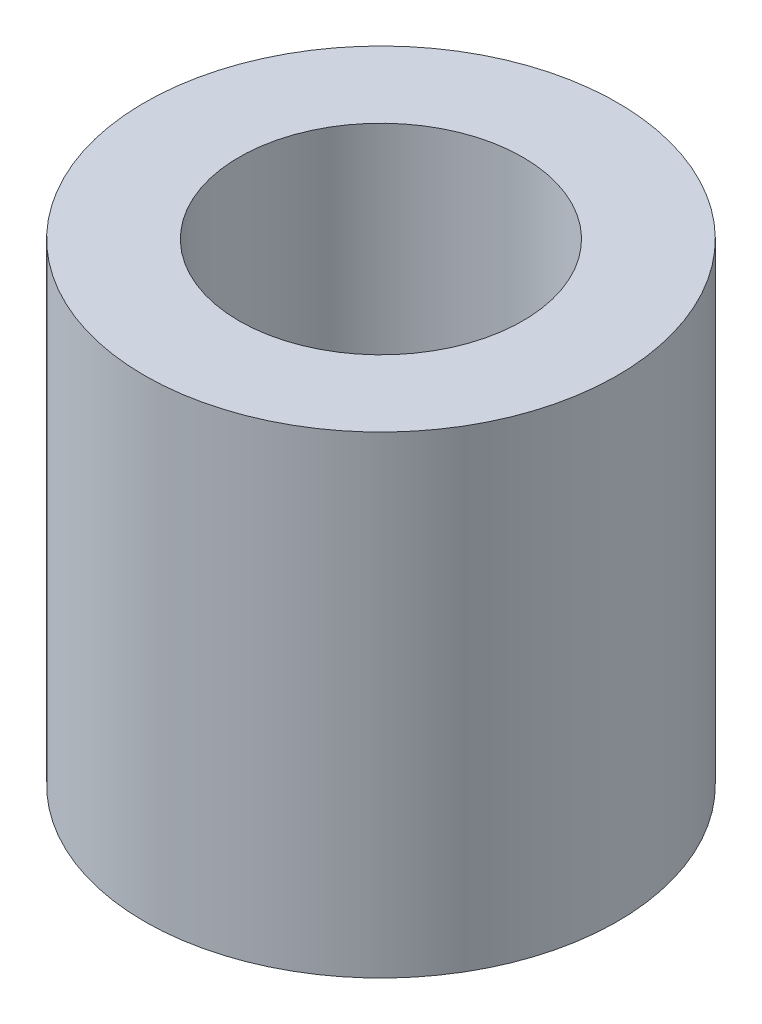
ISO-10303-21;
HEADER;
FILE_DESCRIPTION(('STEP AP214'),'2;1');
FILE_NAME('part.step','',(''),(''),'','','');
FILE_SCHEMA(('AUTOMOTIVE_DESIGN { 1 0 10303 214 1 1 1 1 }'));
ENDSEC;
DATA;
#1=APPLICATION_CONTEXT('core data for automotive mechanical design processes');
#2=APPLICATION_PROTOCOL_DEFINITION('international standard','automotive_design',2000,#1);
#3=PRODUCT_CONTEXT('',#1,'mechanical');
#4=PRODUCT('Part','Part','',(#3));
#5=PRODUCT_RELATED_PRODUCT_CATEGORY('part','',(#4));
#6=PRODUCT_DEFINITION_FORMATION('','',#4);
#7=PRODUCT_DEFINITION_CONTEXT('part definition',#1,'design');
#8=PRODUCT_DEFINITION('design','',#6,#7);
#9=PRODUCT_DEFINITION_SHAPE('','',#8);
#10=(LENGTH_UNIT() NAMED_UNIT(*) SI_UNIT(.MILLI.,.METRE.));
#11=(NAMED_UNIT(*) PLANE_ANGLE_UNIT() SI_UNIT($,.RADIAN.));
#12=(NAMED_UNIT(*) SI_UNIT($,.STERADIAN.) SOLID_ANGLE_UNIT());
#13=UNCERTAINTY_MEASURE_WITH_UNIT(LENGTH_MEASURE(1.E-05),#10,'distance_accuracy_value','');
#14=(GEOMETRIC_REPRESENTATION_CONTEXT(3) GLOBAL_UNCERTAINTY_ASSIGNED_CONTEXT((#13)) GLOBAL_UNIT_ASSIGNED_CONTEXT((#10,
#11,#12)) REPRESENTATION_CONTEXT('',''));
#15=CARTESIAN_POINT('',(0.,0.,0.));
#16=DIRECTION('',(0.,0.,1.));
#17=DIRECTION('',(1.,0.,0.));
#18=AXIS2_PLACEMENT_3D('',#15,#16,#17);
#19=CARTESIAN_POINT('',(0.,5.,0.));
#20=DIRECTION('',(0.,1.,0.));
#21=DIRECTION('',(0.,0.,1.));
#22=AXIS2_PLACEMENT_3D('',#19,#20,#21);
#23=PLANE('',#22);
#24=CARTESIAN_POINT('',(0.,5.,0.));
#25=DIRECTION('',(0.,1.,0.));
#26=DIRECTION('',(0.,0.,1.));
#27=AXIS2_PLACEMENT_3D('',#24,#25,#26);
#28=CIRCLE('',#27,2.5);
#29=CARTESIAN_POINT('',(0.,5.,2.5));
#30=VERTEX_POINT('',#29);
#31=EDGE_CURVE('E10',#30,#30,#28,.T.);
#32=ORIENTED_EDGE('',*,*,#31,.T.);
#33=EDGE_LOOP('',(#32));
#34=FACE_BOUND('',#33,.T.);
#35=CARTESIAN_POINT('',(0.,5.,0.));
#36=DIRECTION('',(0.,1.,0.));
#37=DIRECTION('',(0.,0.,1.));
#38=AXIS2_PLACEMENT_3D('',#35,#36,#37);
#39=CIRCLE('',#38,1.5);
#40=CARTESIAN_POINT('',(0.,5.,1.5));
#41=VERTEX_POINT('',#40);
#42=EDGE_CURVE('E44',#41,#41,#39,.T.);
#43=ORIENTED_EDGE('',*,*,#42,.F.);
#44=EDGE_LOOP('',(#43));
#45=FACE_BOUND('',#44,.T.);
#46=ADVANCED_FACE('F33',(#34,#45),#23,.T.);
#47=CARTESIAN_POINT('',(0.,0.,0.));
#48=DIRECTION('',(0.,1.,0.));
#49=DIRECTION('',(0.,0.,1.));
#50=AXIS2_PLACEMENT_3D('',#47,#48,#49);
#51=PLANE('',#50);
#52=CARTESIAN_POINT('',(0.,0.,0.));
#53=DIRECTION('',(0.,1.,0.));
#54=DIRECTION('',(0.,0.,1.));
#55=AXIS2_PLACEMENT_3D('',#52,#53,#54);
#56=CIRCLE('',#55,2.5);
#57=CARTESIAN_POINT('',(0.,0.,2.5));
#58=VERTEX_POINT('',#57);
#59=EDGE_CURVE('E37',#58,#58,#56,.T.);
#60=ORIENTED_EDGE('',*,*,#59,.F.);
#61=EDGE_LOOP('',(#60));
#62=FACE_BOUND('',#61,.T.);
#63=CARTESIAN_POINT('',(0.,0.,0.));
#64=DIRECTION('',(0.,1.,0.));
#65=DIRECTION('',(0.,0.,1.));
#66=AXIS2_PLACEMENT_3D('',#63,#64,#65);
#67=CIRCLE('',#66,1.5);
#68=CARTESIAN_POINT('',(0.,0.,1.5));
#69=VERTEX_POINT('',#68);
#70=EDGE_CURVE('E46',#69,#69,#67,.T.);
#71=ORIENTED_EDGE('',*,*,#70,.T.);
#72=EDGE_LOOP('',(#71));
#73=FACE_BOUND('',#72,.T.);
#74=ADVANCED_FACE('F56',(#62,#73),#51,.F.);
#75=CARTESIAN_POINT('',(0.,5.,0.));
#76=DIRECTION('',(0.,-1.,0.));
#77=DIRECTION('',(0.,0.,-1.));
#78=AXIS2_PLACEMENT_3D('',#75,#76,#77);
#79=CYLINDRICAL_SURFACE('',#78,2.5);
#80=ORIENTED_EDGE('',*,*,#31,.F.);
#81=EDGE_LOOP('',(#80));
#82=FACE_BOUND('',#81,.T.);
#83=ORIENTED_EDGE('',*,*,#59,.T.);
#84=EDGE_LOOP('',(#83));
#85=FACE_BOUND('',#84,.T.);
#86=ADVANCED_FACE('F35',(#82,#85),#79,.T.);
#87=CARTESIAN_POINT('',(0.,5.,0.));
#88=DIRECTION('',(0.,-1.,0.));
#89=DIRECTION('',(0.,0.,-1.));
#90=AXIS2_PLACEMENT_3D('',#87,#88,#89);
#91=CYLINDRICAL_SURFACE('',#90,1.5);
#92=ORIENTED_EDGE('',*,*,#42,.T.);
#93=EDGE_LOOP('',(#92));
#94=FACE_BOUND('',#93,.T.);
#95=ORIENTED_EDGE('',*,*,#70,.F.);
#96=EDGE_LOOP('',(#95));
#97=FACE_BOUND('',#96,.T.);
#98=ADVANCED_FACE('F52',(#94,#97),#91,.F.);
#99=CLOSED_SHELL('',(#46,#74,#86,#98));
#100=MANIFOLD_SOLID_BREP('B2',#99);
#101=ADVANCED_BREP_SHAPE_REPRESENTATION('',(#18,#100),#14);
#102=SHAPE_DEFINITION_REPRESENTATION(#9,#101);
ENDSEC;
END-ISO-10303-21;
